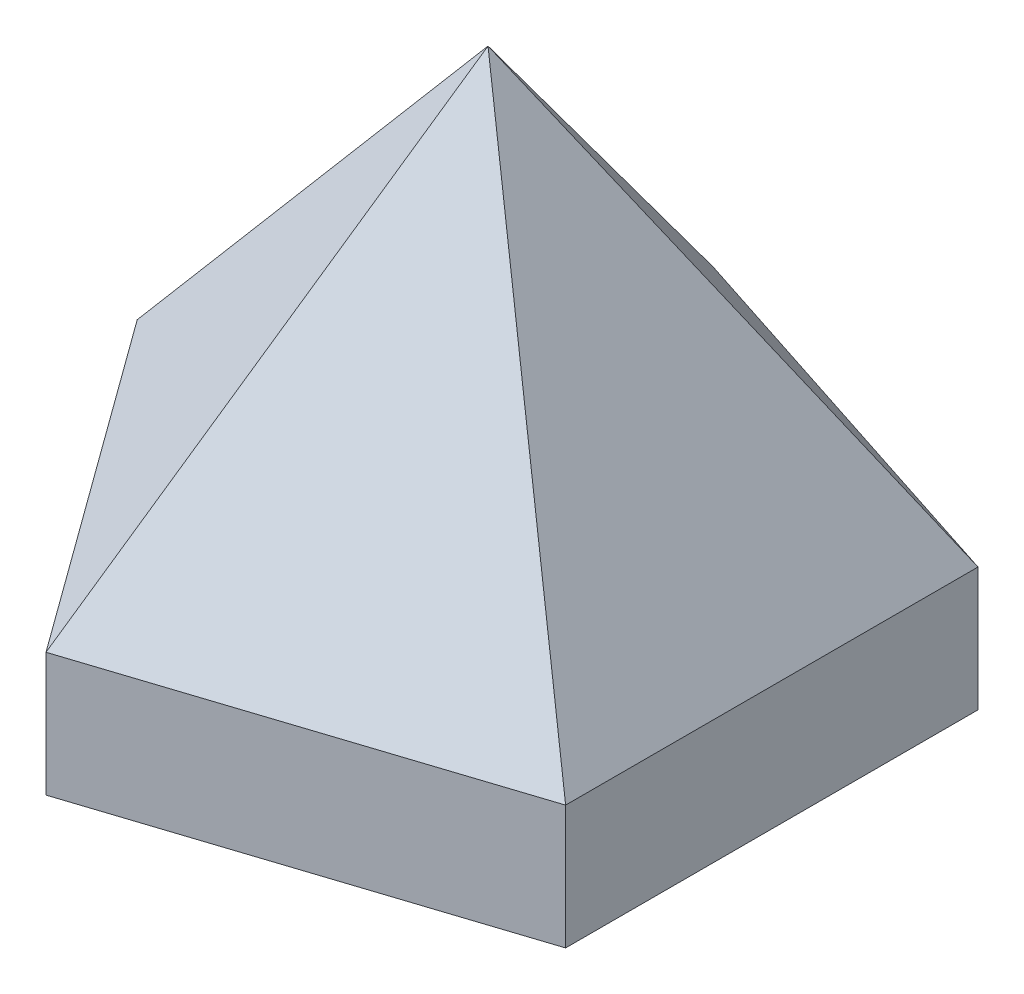
ISO-10303-21;
HEADER;
FILE_DESCRIPTION(('STEP AP214'),'2;1');
FILE_NAME('part.step','',(''),(''),'','','');
FILE_SCHEMA(('AUTOMOTIVE_DESIGN { 1 0 10303 214 1 1 1 1 }'));
ENDSEC;
DATA;
#1=APPLICATION_CONTEXT('core data for automotive mechanical design processes');
#2=APPLICATION_PROTOCOL_DEFINITION('international standard','automotive_design',2000,#1);
#3=PRODUCT_CONTEXT('',#1,'mechanical');
#4=PRODUCT('Part','Part','',(#3));
#5=PRODUCT_RELATED_PRODUCT_CATEGORY('part','',(#4));
#6=PRODUCT_DEFINITION_FORMATION('','',#4);
#7=PRODUCT_DEFINITION_CONTEXT('part definition',#1,'design');
#8=PRODUCT_DEFINITION('design','',#6,#7);
#9=PRODUCT_DEFINITION_SHAPE('','',#8);
#10=(LENGTH_UNIT() NAMED_UNIT(*) SI_UNIT(.MILLI.,.METRE.));
#11=(NAMED_UNIT(*) PLANE_ANGLE_UNIT() SI_UNIT($,.RADIAN.));
#12=(NAMED_UNIT(*) SI_UNIT($,.STERADIAN.) SOLID_ANGLE_UNIT());
#13=UNCERTAINTY_MEASURE_WITH_UNIT(LENGTH_MEASURE(1.E-05),#10,'distance_accuracy_value','');
#14=(GEOMETRIC_REPRESENTATION_CONTEXT(3) GLOBAL_UNCERTAINTY_ASSIGNED_CONTEXT((#13)) GLOBAL_UNIT_ASSIGNED_CONTEXT((#10,
#11,#12)) REPRESENTATION_CONTEXT('',''));
#15=CARTESIAN_POINT('',(0.,0.,0.));
#16=DIRECTION('',(0.,0.,1.));
#17=DIRECTION('',(1.,0.,0.));
#18=AXIS2_PLACEMENT_3D('',#15,#16,#17);
#19=CARTESIAN_POINT('',(40.,15.,55.));
#20=DIRECTION('',(0.809016994374947,0.,-0.587785252292473));
#21=DIRECTION('',(-0.587785252292473,0.,-0.809016994374948));
#22=AXIS2_PLACEMENT_3D('',#19,#20,#21);
#23=PLANE('',#22);
#24=DIRECTION('',(0.587785252292473,0.,0.809016994374947));
#25=VECTOR('',#24,1.);
#26=CARTESIAN_POINT('',(40.,0.,55.));
#27=LINE('',#26,#25);
#28=CARTESIAN_POINT('',(40.,0.,55.));
#29=VERTEX_POINT('',#28);
#30=CARTESIAN_POINT('',(69.3892626146237,0.,95.4508497187474));
#31=VERTEX_POINT('',#30);
#32=EDGE_CURVE('E123',#29,#31,#27,.T.);
#33=ORIENTED_EDGE('',*,*,#32,.T.);
#34=DIRECTION('',(0.,-1.,0.));
#35=VECTOR('',#34,1.);
#36=CARTESIAN_POINT('',(69.3892626146237,15.,95.4508497187474));
#37=LINE('',#36,#35);
#38=CARTESIAN_POINT('',(69.3892626146237,15.,95.4508497187474));
#39=VERTEX_POINT('',#38);
#40=EDGE_CURVE('E12',#39,#31,#37,.T.);
#41=ORIENTED_EDGE('',*,*,#40,.F.);
#42=DIRECTION('',(0.587785252292473,0.,0.809016994374947));
#43=VECTOR('',#42,1.);
#44=CARTESIAN_POINT('',(40.,15.,55.));
#45=LINE('',#44,#43);
#46=CARTESIAN_POINT('',(40.,15.,55.));
#47=VERTEX_POINT('',#46);
#48=EDGE_CURVE('E97',#47,#39,#45,.T.);
#49=ORIENTED_EDGE('',*,*,#48,.F.);
#50=DIRECTION('',(0.,-1.,0.));
#51=VECTOR('',#50,1.);
#52=CARTESIAN_POINT('',(40.,15.,55.));
#53=LINE('',#52,#51);
#54=EDGE_CURVE('E100',#47,#29,#53,.T.);
#55=ORIENTED_EDGE('',*,*,#54,.T.);
#56=EDGE_LOOP('',(#33,#41,#49,#55));
#57=FACE_BOUND('',#56,.T.);
#58=ADVANCED_FACE('F37',(#57),#23,.F.);
#59=CARTESIAN_POINT('',(69.3892626146237,15.,95.4508497187474));
#60=DIRECTION('',(-0.309016994374948,0.,-0.951056516295153));
#61=DIRECTION('',(-0.951056516295154,0.,0.309016994374948));
#62=AXIS2_PLACEMENT_3D('',#59,#60,#61);
#63=PLANE('',#62);
#64=DIRECTION('',(0.951056516295153,0.,-0.309016994374948));
#65=VECTOR('',#64,1.);
#66=CARTESIAN_POINT('',(69.3892626146237,0.,95.4508497187474));
#67=LINE('',#66,#65);
#68=CARTESIAN_POINT('',(116.942088429381,0.,80.));
#69=VERTEX_POINT('',#68);
#70=EDGE_CURVE('E130',#31,#69,#67,.T.);
#71=ORIENTED_EDGE('',*,*,#70,.T.);
#72=DIRECTION('',(0.,-1.,0.));
#73=VECTOR('',#72,1.);
#74=CARTESIAN_POINT('',(116.942088429381,15.,80.));
#75=LINE('',#74,#73);
#76=CARTESIAN_POINT('',(116.942088429381,15.,80.));
#77=VERTEX_POINT('',#76);
#78=EDGE_CURVE('E46',#77,#69,#75,.T.);
#79=ORIENTED_EDGE('',*,*,#78,.F.);
#80=DIRECTION('',(0.951056516295154,0.,-0.309016994374948));
#81=VECTOR('',#80,1.);
#82=CARTESIAN_POINT('',(69.3892626146237,15.,95.4508497187474));
#83=LINE('',#82,#81);
#84=EDGE_CURVE('E70',#39,#77,#83,.T.);
#85=ORIENTED_EDGE('',*,*,#84,.F.);
#86=ORIENTED_EDGE('',*,*,#40,.T.);
#87=EDGE_LOOP('',(#71,#79,#85,#86));
#88=FACE_BOUND('',#87,.T.);
#89=ADVANCED_FACE('F165',(#88),#63,.F.);
#90=CARTESIAN_POINT('',(116.942088429381,15.,80.));
#91=DIRECTION('',(-1.,0.,0.));
#92=DIRECTION('',(0.,0.,1.));
#93=AXIS2_PLACEMENT_3D('',#90,#91,#92);
#94=PLANE('',#93);
#95=DIRECTION('',(0.,0.,-1.));
#96=VECTOR('',#95,1.);
#97=CARTESIAN_POINT('',(116.942088429381,0.,80.));
#98=LINE('',#97,#96);
#99=CARTESIAN_POINT('',(116.942088429381,0.,30.));
#100=VERTEX_POINT('',#99);
#101=EDGE_CURVE('E132',#69,#100,#98,.T.);
#102=ORIENTED_EDGE('',*,*,#101,.T.);
#103=DIRECTION('',(0.,-1.,0.));
#104=VECTOR('',#103,1.);
#105=CARTESIAN_POINT('',(116.942088429381,15.,30.));
#106=LINE('',#105,#104);
#107=CARTESIAN_POINT('',(116.942088429381,15.,30.));
#108=VERTEX_POINT('',#107);
#109=EDGE_CURVE('E138',#108,#100,#106,.T.);
#110=ORIENTED_EDGE('',*,*,#109,.F.);
#111=DIRECTION('',(0.,0.,1.));
#112=VECTOR('',#111,1.);
#113=CARTESIAN_POINT('',(116.942088429381,15.,30.));
#114=LINE('',#113,#112);
#115=EDGE_CURVE('E40',#77,#108,#114,.F.);
#116=ORIENTED_EDGE('',*,*,#115,.F.);
#117=ORIENTED_EDGE('',*,*,#78,.T.);
#118=EDGE_LOOP('',(#102,#110,#116,#117));
#119=FACE_BOUND('',#118,.T.);
#120=ADVANCED_FACE('F149',(#119),#94,.F.);
#121=CARTESIAN_POINT('',(116.942088429381,15.,30.));
#122=DIRECTION('',(-0.309016994374947,0.,0.951056516295154));
#123=DIRECTION('',(0.951056516295154,0.,0.309016994374947));
#124=AXIS2_PLACEMENT_3D('',#121,#122,#123);
#125=PLANE('',#124);
#126=DIRECTION('',(-0.951056516295154,0.,-0.309016994374947));
#127=VECTOR('',#126,1.);
#128=CARTESIAN_POINT('',(116.942088429381,0.,30.));
#129=LINE('',#128,#127);
#130=CARTESIAN_POINT('',(69.3892626146236,0.,14.5491502812526));
#131=VERTEX_POINT('',#130);
#132=EDGE_CURVE('E134',#100,#131,#129,.T.);
#133=ORIENTED_EDGE('',*,*,#132,.T.);
#134=DIRECTION('',(0.,-1.,0.));
#135=VECTOR('',#134,1.);
#136=CARTESIAN_POINT('',(69.3892626146236,15.,14.5491502812526));
#137=LINE('',#136,#135);
#138=CARTESIAN_POINT('',(69.3892626146236,15.,14.5491502812526));
#139=VERTEX_POINT('',#138);
#140=EDGE_CURVE('E54',#139,#131,#137,.T.);
#141=ORIENTED_EDGE('',*,*,#140,.F.);
#142=DIRECTION('',(-0.951056516295154,0.,-0.309016994374947));
#143=VECTOR('',#142,1.);
#144=CARTESIAN_POINT('',(116.942088429381,15.,30.));
#145=LINE('',#144,#143);
#146=EDGE_CURVE('E117',#108,#139,#145,.T.);
#147=ORIENTED_EDGE('',*,*,#146,.F.);
#148=ORIENTED_EDGE('',*,*,#109,.T.);
#149=EDGE_LOOP('',(#133,#141,#147,#148));
#150=FACE_BOUND('',#149,.T.);
#151=ADVANCED_FACE('F172',(#150),#125,.F.);
#152=CARTESIAN_POINT('',(69.3892626146236,15.,14.5491502812526));
#153=DIRECTION('',(0.809016994374948,0.,0.587785252292473));
#154=DIRECTION('',(0.587785252292473,0.,-0.809016994374948));
#155=AXIS2_PLACEMENT_3D('',#152,#153,#154);
#156=PLANE('',#155);
#157=DIRECTION('',(-0.587785252292473,0.,0.809016994374948));
#158=VECTOR('',#157,1.);
#159=CARTESIAN_POINT('',(69.3892626146236,0.,14.5491502812526));
#160=LINE('',#159,#158);
#161=EDGE_CURVE('E106',#131,#29,#160,.T.);
#162=ORIENTED_EDGE('',*,*,#161,.T.);
#163=ORIENTED_EDGE('',*,*,#54,.F.);
#164=DIRECTION('',(-0.587785252292473,0.,0.809016994374948));
#165=VECTOR('',#164,1.);
#166=CARTESIAN_POINT('',(69.3892626146236,15.,14.5491502812526));
#167=LINE('',#166,#165);
#168=EDGE_CURVE('E111',#139,#47,#167,.T.);
#169=ORIENTED_EDGE('',*,*,#168,.F.);
#170=ORIENTED_EDGE('',*,*,#140,.T.);
#171=EDGE_LOOP('',(#162,#163,#169,#170));
#172=FACE_BOUND('',#171,.T.);
#173=ADVANCED_FACE('F110',(#172),#156,.F.);
#174=CARTESIAN_POINT('',(69.3892626146237,0.,95.4508497187474));
#175=DIRECTION('',(0.,1.,0.));
#176=DIRECTION('',(0.,0.,1.));
#177=AXIS2_PLACEMENT_3D('',#174,#175,#176);
#178=PLANE('',#177);
#179=ORIENTED_EDGE('',*,*,#32,.F.);
#180=ORIENTED_EDGE('',*,*,#161,.F.);
#181=ORIENTED_EDGE('',*,*,#132,.F.);
#182=ORIENTED_EDGE('',*,*,#101,.F.);
#183=ORIENTED_EDGE('',*,*,#70,.F.);
#184=EDGE_LOOP('',(#179,#180,#181,#182,#183));
#185=FACE_BOUND('',#184,.T.);
#186=ADVANCED_FACE('F161',(#185),#178,.F.);
#187=CARTESIAN_POINT('',(40.,15.,55.));
#188=DIRECTION('',(0.666448870812314,-0.566915270681799,0.484203447386296));
#189=DIRECTION('',(0.647936163294298,0.761694642422713,0.));
#190=AXIS2_PLACEMENT_3D('',#187,#188,#189);
#191=PLANE('',#190);
#192=DIRECTION('',(0.647936163294298,0.761694642422713,0.));
#193=VECTOR('',#192,1.);
#194=CARTESIAN_POINT('',(40.,15.,55.));
#195=LINE('',#194,#193);
#196=CARTESIAN_POINT('',(82.532540417602,65.,55.));
#197=VERTEX_POINT('',#196);
#198=EDGE_CURVE('E116',#47,#197,#195,.T.);
#199=ORIENTED_EDGE('',*,*,#198,.T.);
#200=DIRECTION('',(0.200223285728039,0.761694642422712,0.616223910244324));
#201=VECTOR('',#200,1.);
#202=CARTESIAN_POINT('',(69.3892626146236,15.,14.5491502812526));
#203=LINE('',#202,#201);
#204=EDGE_CURVE('E91',#139,#197,#203,.T.);
#205=ORIENTED_EDGE('',*,*,#204,.F.);
#206=ORIENTED_EDGE('',*,*,#168,.T.);
#207=EDGE_LOOP('',(#199,#205,#206));
#208=FACE_BOUND('',#207,.T.);
#209=ADVANCED_FACE('F115',(#208),#191,.F.);
#210=CARTESIAN_POINT('',(69.3892626146236,15.,14.5491502812526));
#211=DIRECTION('',(-0.254560816886316,-0.566915270681799,0.783457635340899));
#212=DIRECTION('',(0.,-0.81014647962275,-0.586227499828237));
#213=AXIS2_PLACEMENT_3D('',#210,#211,#212);
#214=PLANE('',#213);
#215=ORIENTED_EDGE('',*,*,#204,.T.);
#216=DIRECTION('',(-0.524191367375189,0.761694642422712,0.380847321211357));
#217=VECTOR('',#216,1.);
#218=CARTESIAN_POINT('',(116.942088429381,15.,30.));
#219=LINE('',#218,#217);
#220=EDGE_CURVE('E147',#108,#197,#219,.T.);
#221=ORIENTED_EDGE('',*,*,#220,.F.);
#222=ORIENTED_EDGE('',*,*,#146,.T.);
#223=EDGE_LOOP('',(#215,#221,#222));
#224=FACE_BOUND('',#223,.T.);
#225=ADVANCED_FACE('F162',(#224),#214,.F.);
#226=CARTESIAN_POINT('',(69.3892626146237,15.,95.4508497187474));
#227=DIRECTION('',(0.666448870812314,-0.566915270681799,-0.484203447386297));
#228=DIRECTION('',(0.647936163294299,0.761694642422713,0.));
#229=AXIS2_PLACEMENT_3D('',#226,#227,#228);
#230=PLANE('',#229);
#231=DIRECTION('',(0.200223285728039,0.761694642422712,-0.616223910244324));
#232=VECTOR('',#231,1.);
#233=CARTESIAN_POINT('',(69.3892626146237,15.,95.4508497187474));
#234=LINE('',#233,#232);
#235=EDGE_CURVE('E120',#39,#197,#234,.T.);
#236=ORIENTED_EDGE('',*,*,#235,.T.);
#237=ORIENTED_EDGE('',*,*,#198,.F.);
#238=ORIENTED_EDGE('',*,*,#48,.T.);
#239=EDGE_LOOP('',(#236,#237,#238));
#240=FACE_BOUND('',#239,.T.);
#241=ADVANCED_FACE('F119',(#240),#230,.F.);
#242=CARTESIAN_POINT('',(116.942088429381,15.,80.));
#243=DIRECTION('',(-0.254560816886316,-0.566915270681799,-0.783457635340899));
#244=DIRECTION('',(0.,0.81014647962275,-0.586227499828237));
#245=AXIS2_PLACEMENT_3D('',#242,#243,#244);
#246=PLANE('',#245);
#247=DIRECTION('',(-0.524191367375189,0.761694642422712,-0.380847321211356));
#248=VECTOR('',#247,1.);
#249=CARTESIAN_POINT('',(116.942088429381,15.,80.));
#250=LINE('',#249,#248);
#251=EDGE_CURVE('E125',#77,#197,#250,.T.);
#252=ORIENTED_EDGE('',*,*,#251,.T.);
#253=ORIENTED_EDGE('',*,*,#235,.F.);
#254=ORIENTED_EDGE('',*,*,#84,.T.);
#255=EDGE_LOOP('',(#252,#253,#254));
#256=FACE_BOUND('',#255,.T.);
#257=ADVANCED_FACE('F152',(#256),#246,.F.);
#258=CARTESIAN_POINT('',(116.942088429381,15.,30.));
#259=DIRECTION('',(-0.823776107851995,-0.566915270681799,0.));
#260=DIRECTION('',(0.566915270681799,-0.823776107851995,0.));
#261=AXIS2_PLACEMENT_3D('',#258,#259,#260);
#262=PLANE('',#261);
#263=ORIENTED_EDGE('',*,*,#220,.T.);
#264=ORIENTED_EDGE('',*,*,#251,.F.);
#265=ORIENTED_EDGE('',*,*,#115,.T.);
#266=EDGE_LOOP('',(#263,#264,#265));
#267=FACE_BOUND('',#266,.T.);
#268=ADVANCED_FACE('F146',(#267),#262,.F.);
#269=CLOSED_SHELL('',(#58,#89,#120,#151,#173,#186,#209,#225,#241,#257,#268));
#270=MANIFOLD_SOLID_BREP('B2',#269);
#271=ADVANCED_BREP_SHAPE_REPRESENTATION('',(#18,#270),#14);
#272=SHAPE_DEFINITION_REPRESENTATION(#9,#271);
ENDSEC;
END-ISO-10303-21;
